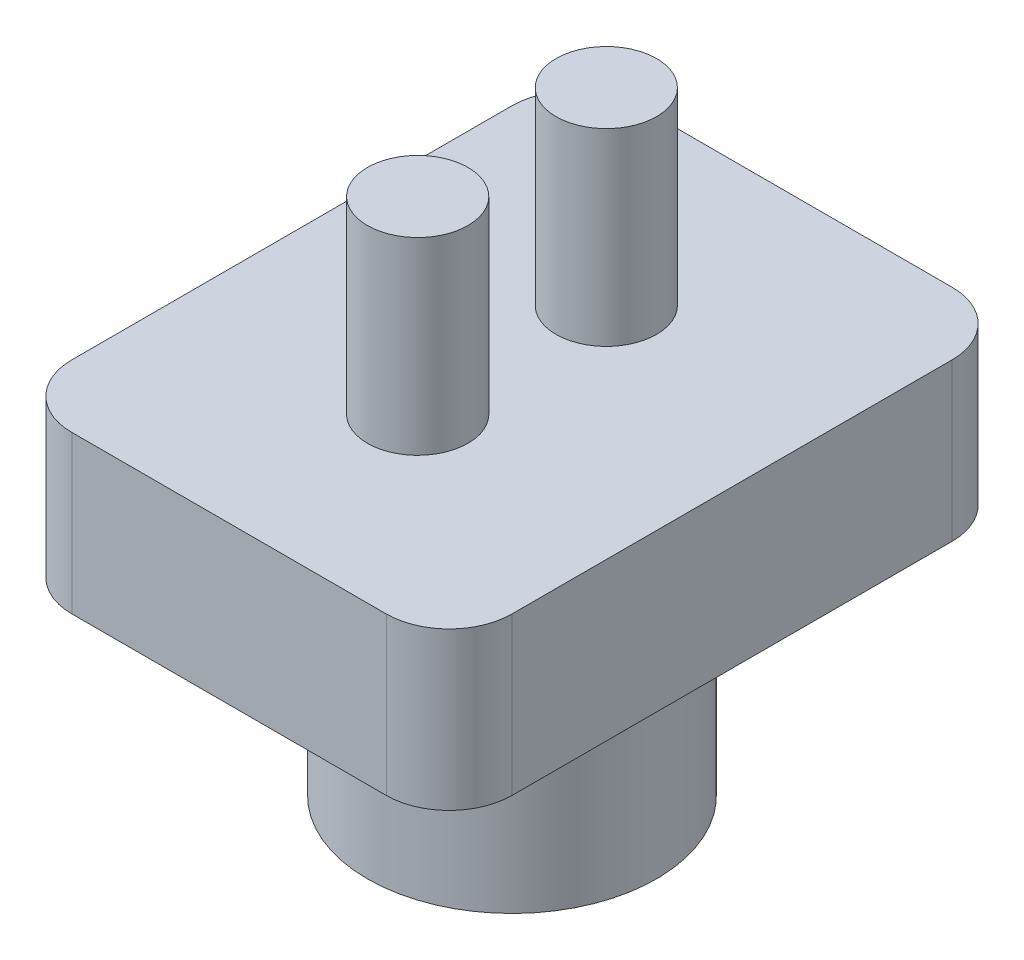
ISO-10303-21;
HEADER;
FILE_DESCRIPTION(('STEP AP214'),'2;1');
FILE_NAME('part.step','',(''),(''),'','','');
FILE_SCHEMA(('AUTOMOTIVE_DESIGN { 1 0 10303 214 1 1 1 1 }'));
ENDSEC;
DATA;
#1=APPLICATION_CONTEXT('core data for automotive mechanical design processes');
#2=APPLICATION_PROTOCOL_DEFINITION('international standard','automotive_design',2000,#1);
#3=PRODUCT_CONTEXT('',#1,'mechanical');
#4=PRODUCT('Part','Part','',(#3));
#5=PRODUCT_RELATED_PRODUCT_CATEGORY('part','',(#4));
#6=PRODUCT_DEFINITION_FORMATION('','',#4);
#7=PRODUCT_DEFINITION_CONTEXT('part definition',#1,'design');
#8=PRODUCT_DEFINITION('design','',#6,#7);
#9=PRODUCT_DEFINITION_SHAPE('','',#8);
#10=(LENGTH_UNIT() NAMED_UNIT(*) SI_UNIT(.MILLI.,.METRE.));
#11=(NAMED_UNIT(*) PLANE_ANGLE_UNIT() SI_UNIT($,.RADIAN.));
#12=(NAMED_UNIT(*) SI_UNIT($,.STERADIAN.) SOLID_ANGLE_UNIT());
#13=UNCERTAINTY_MEASURE_WITH_UNIT(LENGTH_MEASURE(1.E-05),#10,'distance_accuracy_value','');
#14=(GEOMETRIC_REPRESENTATION_CONTEXT(3) GLOBAL_UNCERTAINTY_ASSIGNED_CONTEXT((#13)) GLOBAL_UNIT_ASSIGNED_CONTEXT((#10,
#11,#12)) REPRESENTATION_CONTEXT('',''));
#15=CARTESIAN_POINT('',(0.,0.,0.));
#16=DIRECTION('',(0.,0.,1.));
#17=DIRECTION('',(1.,0.,0.));
#18=AXIS2_PLACEMENT_3D('',#15,#16,#17);
#19=CARTESIAN_POINT('',(0.,7.,0.));
#20=DIRECTION('',(0.,-1.,0.));
#21=DIRECTION('',(0.,0.,-1.));
#22=AXIS2_PLACEMENT_3D('',#19,#20,#21);
#23=CYLINDRICAL_SURFACE('',#22,2.8);
#24=CARTESIAN_POINT('',(0.,7.,0.));
#25=DIRECTION('',(0.,1.,0.));
#26=DIRECTION('',(0.,0.,1.));
#27=AXIS2_PLACEMENT_3D('',#24,#25,#26);
#28=CIRCLE('',#27,2.8);
#29=CARTESIAN_POINT('',(0.,7.,2.8));
#30=VERTEX_POINT('',#29);
#31=EDGE_CURVE('E144',#30,#30,#28,.T.);
#32=ORIENTED_EDGE('',*,*,#31,.T.);
#33=EDGE_LOOP('',(#32));
#34=FACE_BOUND('',#33,.T.);
#35=CARTESIAN_POINT('',(0.,0.,0.));
#36=DIRECTION('',(0.,1.,0.));
#37=DIRECTION('',(0.,0.,1.));
#38=AXIS2_PLACEMENT_3D('',#35,#36,#37);
#39=CIRCLE('',#38,2.8);
#40=CARTESIAN_POINT('',(0.,0.,2.8));
#41=VERTEX_POINT('',#40);
#42=EDGE_CURVE('E147',#41,#41,#39,.T.);
#43=ORIENTED_EDGE('',*,*,#42,.F.);
#44=EDGE_LOOP('',(#43));
#45=FACE_BOUND('',#44,.T.);
#46=ADVANCED_FACE('F35',(#34,#45),#23,.F.);
#47=CARTESIAN_POINT('',(0.,7.,0.));
#48=DIRECTION('',(0.,-1.,0.));
#49=DIRECTION('',(0.,0.,-1.));
#50=AXIS2_PLACEMENT_3D('',#47,#48,#49);
#51=CYLINDRICAL_SURFACE('',#50,4.6);
#52=CARTESIAN_POINT('',(0.,7.,0.));
#53=DIRECTION('',(0.,1.,0.));
#54=DIRECTION('',(0.,0.,1.));
#55=AXIS2_PLACEMENT_3D('',#52,#53,#54);
#56=CIRCLE('',#55,4.6);
#57=CARTESIAN_POINT('',(0.,7.,4.6));
#58=VERTEX_POINT('',#57);
#59=EDGE_CURVE('E148',#58,#58,#56,.T.);
#60=ORIENTED_EDGE('',*,*,#59,.F.);
#61=EDGE_LOOP('',(#60));
#62=FACE_BOUND('',#61,.T.);
#63=CARTESIAN_POINT('',(0.,0.,0.));
#64=DIRECTION('',(0.,1.,0.));
#65=DIRECTION('',(0.,0.,1.));
#66=AXIS2_PLACEMENT_3D('',#63,#64,#65);
#67=CIRCLE('',#66,4.6);
#68=CARTESIAN_POINT('',(0.,0.,4.6));
#69=VERTEX_POINT('',#68);
#70=EDGE_CURVE('E151',#69,#69,#67,.T.);
#71=ORIENTED_EDGE('',*,*,#70,.T.);
#72=EDGE_LOOP('',(#71));
#73=FACE_BOUND('',#72,.T.);
#74=ADVANCED_FACE('F230',(#62,#73),#51,.T.);
#75=CARTESIAN_POINT('',(0.,0.,0.));
#76=DIRECTION('',(0.,1.,0.));
#77=DIRECTION('',(0.,0.,1.));
#78=AXIS2_PLACEMENT_3D('',#75,#76,#77);
#79=PLANE('',#78);
#80=ORIENTED_EDGE('',*,*,#42,.T.);
#81=EDGE_LOOP('',(#80));
#82=FACE_BOUND('',#81,.T.);
#83=ORIENTED_EDGE('',*,*,#70,.F.);
#84=EDGE_LOOP('',(#83));
#85=FACE_BOUND('',#84,.T.);
#86=ADVANCED_FACE('F236',(#82,#85),#79,.F.);
#87=CARTESIAN_POINT('',(0.,7.,0.));
#88=DIRECTION('',(0.,1.,0.));
#89=DIRECTION('',(0.,0.,1.));
#90=AXIS2_PLACEMENT_3D('',#87,#88,#89);
#91=PLANE('',#90);
#92=ORIENTED_EDGE('',*,*,#59,.T.);
#93=EDGE_LOOP('',(#92));
#94=FACE_BOUND('',#93,.T.);
#95=DIRECTION('',(1.,0.,0.));
#96=VECTOR('',#95,1.);
#97=CARTESIAN_POINT('',(0.,7.,9.));
#98=LINE('',#97,#96);
#99=CARTESIAN_POINT('',(-5.,7.,9.));
#100=VERTEX_POINT('',#99);
#101=CARTESIAN_POINT('',(5.,7.,9.));
#102=VERTEX_POINT('',#101);
#103=EDGE_CURVE('E118',#100,#102,#98,.T.);
#104=ORIENTED_EDGE('',*,*,#103,.F.);
#105=CARTESIAN_POINT('',(-5.,7.,7.));
#106=DIRECTION('',(0.,1.,0.));
#107=DIRECTION('',(0.,0.,1.));
#108=AXIS2_PLACEMENT_3D('',#105,#106,#107);
#109=CIRCLE('',#108,2.);
#110=CARTESIAN_POINT('',(-7.,7.,7.));
#111=VERTEX_POINT('',#110);
#112=EDGE_CURVE('E101',#100,#111,#109,.F.);
#113=ORIENTED_EDGE('',*,*,#112,.T.);
#114=DIRECTION('',(0.,0.,-1.));
#115=VECTOR('',#114,1.);
#116=CARTESIAN_POINT('',(-7.,7.,0.));
#117=LINE('',#116,#115);
#118=CARTESIAN_POINT('',(-7.,7.,-7.));
#119=VERTEX_POINT('',#118);
#120=EDGE_CURVE('E142',#111,#119,#117,.T.);
#121=ORIENTED_EDGE('',*,*,#120,.T.);
#122=CARTESIAN_POINT('',(-5.,7.,-7.));
#123=DIRECTION('',(0.,1.,0.));
#124=DIRECTION('',(0.,0.,1.));
#125=AXIS2_PLACEMENT_3D('',#122,#123,#124);
#126=CIRCLE('',#125,2.);
#127=CARTESIAN_POINT('',(-5.,7.,-9.));
#128=VERTEX_POINT('',#127);
#129=EDGE_CURVE('E112',#119,#128,#126,.F.);
#130=ORIENTED_EDGE('',*,*,#129,.T.);
#131=DIRECTION('',(1.,0.,0.));
#132=VECTOR('',#131,1.);
#133=CARTESIAN_POINT('',(0.,7.,-9.));
#134=LINE('',#133,#132);
#135=CARTESIAN_POINT('',(5.,7.,-9.));
#136=VERTEX_POINT('',#135);
#137=EDGE_CURVE('E131',#128,#136,#134,.T.);
#138=ORIENTED_EDGE('',*,*,#137,.T.);
#139=CARTESIAN_POINT('',(5.,7.,-7.));
#140=DIRECTION('',(0.,1.,0.));
#141=DIRECTION('',(0.,0.,1.));
#142=AXIS2_PLACEMENT_3D('',#139,#140,#141);
#143=CIRCLE('',#142,2.);
#144=CARTESIAN_POINT('',(7.,7.,-7.));
#145=VERTEX_POINT('',#144);
#146=EDGE_CURVE('E158',#136,#145,#143,.F.);
#147=ORIENTED_EDGE('',*,*,#146,.T.);
#148=DIRECTION('',(0.,0.,-1.));
#149=VECTOR('',#148,1.);
#150=CARTESIAN_POINT('',(7.,7.,0.));
#151=LINE('',#150,#149);
#152=CARTESIAN_POINT('',(7.,7.,7.));
#153=VERTEX_POINT('',#152);
#154=EDGE_CURVE('E127',#153,#145,#151,.T.);
#155=ORIENTED_EDGE('',*,*,#154,.F.);
#156=CARTESIAN_POINT('',(5.,7.,7.));
#157=DIRECTION('',(0.,1.,0.));
#158=DIRECTION('',(0.,0.,1.));
#159=AXIS2_PLACEMENT_3D('',#156,#157,#158);
#160=CIRCLE('',#159,2.);
#161=EDGE_CURVE('E122',#153,#102,#160,.F.);
#162=ORIENTED_EDGE('',*,*,#161,.T.);
#163=EDGE_LOOP('',(#104,#113,#121,#130,#138,#147,#155,#162));
#164=FACE_BOUND('',#163,.T.);
#165=ADVANCED_FACE('F125',(#94,#164),#91,.F.);
#166=CARTESIAN_POINT('',(0.,12.,0.));
#167=DIRECTION('',(0.,1.,0.));
#168=DIRECTION('',(0.,0.,1.));
#169=AXIS2_PLACEMENT_3D('',#166,#167,#168);
#170=PLANE('',#169);
#171=CARTESIAN_POINT('',(0.,12.,3.));
#172=DIRECTION('',(0.,1.,0.));
#173=DIRECTION('',(0.,0.,1.));
#174=AXIS2_PLACEMENT_3D('',#171,#172,#173);
#175=CIRCLE('',#174,1.6);
#176=CARTESIAN_POINT('',(0.,12.,4.6));
#177=VERTEX_POINT('',#176);
#178=EDGE_CURVE('E196',#177,#177,#175,.T.);
#179=ORIENTED_EDGE('',*,*,#178,.F.);
#180=EDGE_LOOP('',(#179));
#181=FACE_BOUND('',#180,.T.);
#182=CARTESIAN_POINT('',(0.,12.,-3.));
#183=DIRECTION('',(0.,1.,0.));
#184=DIRECTION('',(0.,0.,1.));
#185=AXIS2_PLACEMENT_3D('',#182,#183,#184);
#186=CIRCLE('',#185,1.6);
#187=CARTESIAN_POINT('',(0.,12.,-1.4));
#188=VERTEX_POINT('',#187);
#189=EDGE_CURVE('E134',#188,#188,#186,.T.);
#190=ORIENTED_EDGE('',*,*,#189,.F.);
#191=EDGE_LOOP('',(#190));
#192=FACE_BOUND('',#191,.T.);
#193=DIRECTION('',(0.,0.,-1.));
#194=VECTOR('',#193,1.);
#195=CARTESIAN_POINT('',(-7.,12.,0.));
#196=LINE('',#195,#194);
#197=CARTESIAN_POINT('',(-7.,12.,7.));
#198=VERTEX_POINT('',#197);
#199=CARTESIAN_POINT('',(-7.,12.,-7.));
#200=VERTEX_POINT('',#199);
#201=EDGE_CURVE('E137',#198,#200,#196,.T.);
#202=ORIENTED_EDGE('',*,*,#201,.F.);
#203=CARTESIAN_POINT('',(-5.,12.,7.));
#204=DIRECTION('',(0.,1.,0.));
#205=DIRECTION('',(0.,0.,1.));
#206=AXIS2_PLACEMENT_3D('',#203,#204,#205);
#207=CIRCLE('',#206,2.);
#208=CARTESIAN_POINT('',(-5.,12.,9.));
#209=VERTEX_POINT('',#208);
#210=EDGE_CURVE('E169',#198,#209,#207,.T.);
#211=ORIENTED_EDGE('',*,*,#210,.T.);
#212=DIRECTION('',(1.,0.,0.));
#213=VECTOR('',#212,1.);
#214=CARTESIAN_POINT('',(0.,12.,9.));
#215=LINE('',#214,#213);
#216=CARTESIAN_POINT('',(5.,12.,9.));
#217=VERTEX_POINT('',#216);
#218=EDGE_CURVE('E121',#209,#217,#215,.T.);
#219=ORIENTED_EDGE('',*,*,#218,.T.);
#220=CARTESIAN_POINT('',(5.,12.,7.));
#221=DIRECTION('',(0.,1.,0.));
#222=DIRECTION('',(0.,0.,1.));
#223=AXIS2_PLACEMENT_3D('',#220,#221,#222);
#224=CIRCLE('',#223,2.);
#225=CARTESIAN_POINT('',(7.,12.,7.));
#226=VERTEX_POINT('',#225);
#227=EDGE_CURVE('E164',#217,#226,#224,.T.);
#228=ORIENTED_EDGE('',*,*,#227,.T.);
#229=DIRECTION('',(0.,0.,-1.));
#230=VECTOR('',#229,1.);
#231=CARTESIAN_POINT('',(7.,12.,0.));
#232=LINE('',#231,#230);
#233=CARTESIAN_POINT('',(7.,12.,-7.));
#234=VERTEX_POINT('',#233);
#235=EDGE_CURVE('E180',#226,#234,#232,.T.);
#236=ORIENTED_EDGE('',*,*,#235,.T.);
#237=CARTESIAN_POINT('',(5.,12.,-7.));
#238=DIRECTION('',(0.,1.,0.));
#239=DIRECTION('',(0.,0.,1.));
#240=AXIS2_PLACEMENT_3D('',#237,#238,#239);
#241=CIRCLE('',#240,2.);
#242=CARTESIAN_POINT('',(5.,12.,-9.));
#243=VERTEX_POINT('',#242);
#244=EDGE_CURVE('E50',#234,#243,#241,.T.);
#245=ORIENTED_EDGE('',*,*,#244,.T.);
#246=DIRECTION('',(1.,0.,0.));
#247=VECTOR('',#246,1.);
#248=CARTESIAN_POINT('',(0.,12.,-9.));
#249=LINE('',#248,#247);
#250=CARTESIAN_POINT('',(-5.,12.,-9.));
#251=VERTEX_POINT('',#250);
#252=EDGE_CURVE('E187',#251,#243,#249,.T.);
#253=ORIENTED_EDGE('',*,*,#252,.F.);
#254=CARTESIAN_POINT('',(-5.,12.,-7.));
#255=DIRECTION('',(0.,1.,0.));
#256=DIRECTION('',(0.,0.,1.));
#257=AXIS2_PLACEMENT_3D('',#254,#255,#256);
#258=CIRCLE('',#257,2.);
#259=EDGE_CURVE('E167',#251,#200,#258,.T.);
#260=ORIENTED_EDGE('',*,*,#259,.T.);
#261=EDGE_LOOP('',(#202,#211,#219,#228,#236,#245,#253,#260));
#262=FACE_BOUND('',#261,.T.);
#263=ADVANCED_FACE('F211',(#181,#192,#262),#170,.T.);
#264=CARTESIAN_POINT('',(-7.,12.,0.));
#265=DIRECTION('',(-1.,0.,0.));
#266=DIRECTION('',(0.,0.,1.));
#267=AXIS2_PLACEMENT_3D('',#264,#265,#266);
#268=PLANE('',#267);
#269=ORIENTED_EDGE('',*,*,#120,.F.);
#270=DIRECTION('',(0.,-1.,0.));
#271=VECTOR('',#270,1.);
#272=CARTESIAN_POINT('',(-7.,12.,7.));
#273=LINE('',#272,#271);
#274=EDGE_CURVE('E106',#111,#198,#273,.F.);
#275=ORIENTED_EDGE('',*,*,#274,.T.);
#276=ORIENTED_EDGE('',*,*,#201,.T.);
#277=DIRECTION('',(0.,-1.,0.));
#278=VECTOR('',#277,1.);
#279=CARTESIAN_POINT('',(-7.,12.,-7.));
#280=LINE('',#279,#278);
#281=EDGE_CURVE('E111',#200,#119,#280,.T.);
#282=ORIENTED_EDGE('',*,*,#281,.T.);
#283=EDGE_LOOP('',(#269,#275,#276,#282));
#284=FACE_BOUND('',#283,.T.);
#285=ADVANCED_FACE('F214',(#284),#268,.T.);
#286=CARTESIAN_POINT('',(0.,12.,-9.));
#287=DIRECTION('',(0.,0.,-1.));
#288=DIRECTION('',(-1.,0.,0.));
#289=AXIS2_PLACEMENT_3D('',#286,#287,#288);
#290=PLANE('',#289);
#291=ORIENTED_EDGE('',*,*,#137,.F.);
#292=DIRECTION('',(0.,-1.,0.));
#293=VECTOR('',#292,1.);
#294=CARTESIAN_POINT('',(-5.,12.,-9.));
#295=LINE('',#294,#293);
#296=EDGE_CURVE('E57',#128,#251,#295,.F.);
#297=ORIENTED_EDGE('',*,*,#296,.T.);
#298=ORIENTED_EDGE('',*,*,#252,.T.);
#299=DIRECTION('',(0.,-1.,0.));
#300=VECTOR('',#299,1.);
#301=CARTESIAN_POINT('',(5.,7.,-9.));
#302=LINE('',#301,#300);
#303=EDGE_CURVE('E171',#243,#136,#302,.T.);
#304=ORIENTED_EDGE('',*,*,#303,.T.);
#305=EDGE_LOOP('',(#291,#297,#298,#304));
#306=FACE_BOUND('',#305,.T.);
#307=ADVANCED_FACE('F186',(#306),#290,.T.);
#308=CARTESIAN_POINT('',(7.,12.,0.));
#309=DIRECTION('',(-1.,0.,0.));
#310=DIRECTION('',(0.,0.,1.));
#311=AXIS2_PLACEMENT_3D('',#308,#309,#310);
#312=PLANE('',#311);
#313=ORIENTED_EDGE('',*,*,#154,.T.);
#314=DIRECTION('',(0.,-1.,0.));
#315=VECTOR('',#314,1.);
#316=CARTESIAN_POINT('',(7.,12.,-7.));
#317=LINE('',#316,#315);
#318=EDGE_CURVE('E11',#145,#234,#317,.F.);
#319=ORIENTED_EDGE('',*,*,#318,.T.);
#320=ORIENTED_EDGE('',*,*,#235,.F.);
#321=DIRECTION('',(0.,-1.,0.));
#322=VECTOR('',#321,1.);
#323=CARTESIAN_POINT('',(7.,12.,7.));
#324=LINE('',#323,#322);
#325=EDGE_CURVE('E43',#226,#153,#324,.T.);
#326=ORIENTED_EDGE('',*,*,#325,.T.);
#327=EDGE_LOOP('',(#313,#319,#320,#326));
#328=FACE_BOUND('',#327,.T.);
#329=ADVANCED_FACE('F178',(#328),#312,.F.);
#330=CARTESIAN_POINT('',(0.,12.,9.));
#331=DIRECTION('',(0.,0.,-1.));
#332=DIRECTION('',(-1.,0.,0.));
#333=AXIS2_PLACEMENT_3D('',#330,#331,#332);
#334=PLANE('',#333);
#335=ORIENTED_EDGE('',*,*,#218,.F.);
#336=DIRECTION('',(0.,-1.,0.));
#337=VECTOR('',#336,1.);
#338=CARTESIAN_POINT('',(-5.,7.,9.));
#339=LINE('',#338,#337);
#340=EDGE_CURVE('E105',#209,#100,#339,.T.);
#341=ORIENTED_EDGE('',*,*,#340,.T.);
#342=ORIENTED_EDGE('',*,*,#103,.T.);
#343=DIRECTION('',(0.,-1.,0.));
#344=VECTOR('',#343,1.);
#345=CARTESIAN_POINT('',(5.,12.,9.));
#346=LINE('',#345,#344);
#347=EDGE_CURVE('E123',#102,#217,#346,.F.);
#348=ORIENTED_EDGE('',*,*,#347,.T.);
#349=EDGE_LOOP('',(#335,#341,#342,#348));
#350=FACE_BOUND('',#349,.T.);
#351=ADVANCED_FACE('F117',(#350),#334,.F.);
#352=ORIENTED_EDGE('',*,*,#31,.F.);
#353=EDGE_LOOP('',(#352));
#354=FACE_BOUND('',#353,.T.);
#355=ADVANCED_FACE('F246',(#354),#91,.F.);
#356=CARTESIAN_POINT('',(0.,18.,-3.));
#357=DIRECTION('',(0.,-1.,0.));
#358=DIRECTION('',(0.,0.,-1.));
#359=AXIS2_PLACEMENT_3D('',#356,#357,#358);
#360=CYLINDRICAL_SURFACE('',#359,1.6);
#361=CARTESIAN_POINT('',(0.,18.,-3.));
#362=DIRECTION('',(0.,1.,0.));
#363=DIRECTION('',(0.,0.,1.));
#364=AXIS2_PLACEMENT_3D('',#361,#362,#363);
#365=CIRCLE('',#364,1.6);
#366=CARTESIAN_POINT('',(0.,18.,-1.4));
#367=VERTEX_POINT('',#366);
#368=EDGE_CURVE('E128',#367,#367,#365,.T.);
#369=ORIENTED_EDGE('',*,*,#368,.F.);
#370=EDGE_LOOP('',(#369));
#371=FACE_BOUND('',#370,.T.);
#372=ORIENTED_EDGE('',*,*,#189,.T.);
#373=EDGE_LOOP('',(#372));
#374=FACE_BOUND('',#373,.T.);
#375=ADVANCED_FACE('F256',(#371,#374),#360,.T.);
#376=CARTESIAN_POINT('',(0.,18.,-3.));
#377=DIRECTION('',(0.,1.,0.));
#378=DIRECTION('',(0.,0.,1.));
#379=AXIS2_PLACEMENT_3D('',#376,#377,#378);
#380=PLANE('',#379);
#381=ORIENTED_EDGE('',*,*,#368,.T.);
#382=EDGE_LOOP('',(#381));
#383=FACE_BOUND('',#382,.T.);
#384=ADVANCED_FACE('F207',(#383),#380,.T.);
#385=CARTESIAN_POINT('',(0.,18.,3.));
#386=DIRECTION('',(0.,-1.,0.));
#387=DIRECTION('',(0.,0.,-1.));
#388=AXIS2_PLACEMENT_3D('',#385,#386,#387);
#389=CYLINDRICAL_SURFACE('',#388,1.6);
#390=CARTESIAN_POINT('',(0.,18.,3.));
#391=DIRECTION('',(0.,1.,0.));
#392=DIRECTION('',(0.,0.,1.));
#393=AXIS2_PLACEMENT_3D('',#390,#391,#392);
#394=CIRCLE('',#393,1.6);
#395=CARTESIAN_POINT('',(0.,18.,4.6));
#396=VERTEX_POINT('',#395);
#397=EDGE_CURVE('E194',#396,#396,#394,.T.);
#398=ORIENTED_EDGE('',*,*,#397,.F.);
#399=EDGE_LOOP('',(#398));
#400=FACE_BOUND('',#399,.T.);
#401=ORIENTED_EDGE('',*,*,#178,.T.);
#402=EDGE_LOOP('',(#401));
#403=FACE_BOUND('',#402,.T.);
#404=ADVANCED_FACE('F204',(#400,#403),#389,.T.);
#405=CARTESIAN_POINT('',(0.,18.,3.));
#406=DIRECTION('',(0.,1.,0.));
#407=DIRECTION('',(0.,0.,1.));
#408=AXIS2_PLACEMENT_3D('',#405,#406,#407);
#409=PLANE('',#408);
#410=ORIENTED_EDGE('',*,*,#397,.T.);
#411=EDGE_LOOP('',(#410));
#412=FACE_BOUND('',#411,.T.);
#413=ADVANCED_FACE('F202',(#412),#409,.T.);
#414=CARTESIAN_POINT('',(-5.,12.,7.));
#415=DIRECTION('',(0.,1.,0.));
#416=DIRECTION('',(0.,0.,1.));
#417=AXIS2_PLACEMENT_3D('',#414,#415,#416);
#418=CYLINDRICAL_SURFACE('',#417,2.);
#419=ORIENTED_EDGE('',*,*,#210,.F.);
#420=ORIENTED_EDGE('',*,*,#274,.F.);
#421=ORIENTED_EDGE('',*,*,#112,.F.);
#422=ORIENTED_EDGE('',*,*,#340,.F.);
#423=EDGE_LOOP('',(#419,#420,#421,#422));
#424=FACE_BOUND('',#423,.T.);
#425=ADVANCED_FACE('F104',(#424),#418,.T.);
#426=CARTESIAN_POINT('',(-5.,12.,-7.));
#427=DIRECTION('',(0.,-1.,0.));
#428=DIRECTION('',(0.,0.,-1.));
#429=AXIS2_PLACEMENT_3D('',#426,#427,#428);
#430=CYLINDRICAL_SURFACE('',#429,2.);
#431=ORIENTED_EDGE('',*,*,#259,.F.);
#432=ORIENTED_EDGE('',*,*,#296,.F.);
#433=ORIENTED_EDGE('',*,*,#129,.F.);
#434=ORIENTED_EDGE('',*,*,#281,.F.);
#435=EDGE_LOOP('',(#431,#432,#433,#434));
#436=FACE_BOUND('',#435,.T.);
#437=ADVANCED_FACE('F221',(#436),#430,.T.);
#438=CARTESIAN_POINT('',(5.,12.,-7.));
#439=DIRECTION('',(0.,1.,0.));
#440=DIRECTION('',(0.,0.,1.));
#441=AXIS2_PLACEMENT_3D('',#438,#439,#440);
#442=CYLINDRICAL_SURFACE('',#441,2.);
#443=ORIENTED_EDGE('',*,*,#244,.F.);
#444=ORIENTED_EDGE('',*,*,#318,.F.);
#445=ORIENTED_EDGE('',*,*,#146,.F.);
#446=ORIENTED_EDGE('',*,*,#303,.F.);
#447=EDGE_LOOP('',(#443,#444,#445,#446));
#448=FACE_BOUND('',#447,.T.);
#449=ADVANCED_FACE('F185',(#448),#442,.T.);
#450=CARTESIAN_POINT('',(5.,12.,7.));
#451=DIRECTION('',(0.,-1.,0.));
#452=DIRECTION('',(0.,0.,-1.));
#453=AXIS2_PLACEMENT_3D('',#450,#451,#452);
#454=CYLINDRICAL_SURFACE('',#453,2.);
#455=ORIENTED_EDGE('',*,*,#227,.F.);
#456=ORIENTED_EDGE('',*,*,#347,.F.);
#457=ORIENTED_EDGE('',*,*,#161,.F.);
#458=ORIENTED_EDGE('',*,*,#325,.F.);
#459=EDGE_LOOP('',(#455,#456,#457,#458));
#460=FACE_BOUND('',#459,.T.);
#461=ADVANCED_FACE('F37',(#460),#454,.T.);
#462=CLOSED_SHELL('',(#46,#74,#86,#165,#263,#285,#307,#329,#351,#355,#375,#384,#404,#413,#425,
#437,#449,#461));
#463=MANIFOLD_SOLID_BREP('B2',#462);
#464=ADVANCED_BREP_SHAPE_REPRESENTATION('',(#18,#463),#14);
#465=SHAPE_DEFINITION_REPRESENTATION(#9,#464);
ENDSEC;
END-ISO-10303-21;
